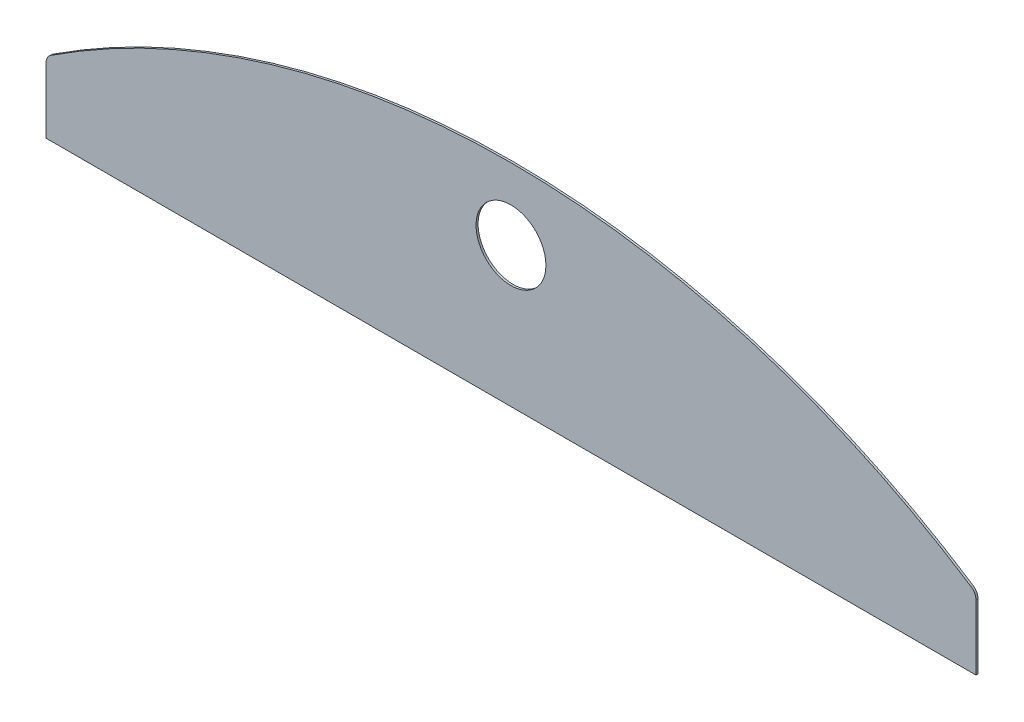
ISO-10303-21;
HEADER;
FILE_DESCRIPTION(('STEP AP214'),'2;1');
FILE_NAME('part.step','',(''),(''),'','','');
FILE_SCHEMA(('AUTOMOTIVE_DESIGN { 1 0 10303 214 1 1 1 1 }'));
ENDSEC;
DATA;
#1=APPLICATION_CONTEXT('core data for automotive mechanical design processes');
#2=APPLICATION_PROTOCOL_DEFINITION('international standard','automotive_design',2000,#1);
#3=PRODUCT_CONTEXT('',#1,'mechanical');
#4=PRODUCT('Part','Part','',(#3));
#5=PRODUCT_RELATED_PRODUCT_CATEGORY('part','',(#4));
#6=PRODUCT_DEFINITION_FORMATION('','',#4);
#7=PRODUCT_DEFINITION_CONTEXT('part definition',#1,'design');
#8=PRODUCT_DEFINITION('design','',#6,#7);
#9=PRODUCT_DEFINITION_SHAPE('','',#8);
#10=(LENGTH_UNIT() NAMED_UNIT(*) SI_UNIT(.MILLI.,.METRE.));
#11=(NAMED_UNIT(*) PLANE_ANGLE_UNIT() SI_UNIT($,.RADIAN.));
#12=(NAMED_UNIT(*) SI_UNIT($,.STERADIAN.) SOLID_ANGLE_UNIT());
#13=UNCERTAINTY_MEASURE_WITH_UNIT(LENGTH_MEASURE(1.E-05),#10,'distance_accuracy_value','');
#14=(GEOMETRIC_REPRESENTATION_CONTEXT(3) GLOBAL_UNCERTAINTY_ASSIGNED_CONTEXT((#13)) GLOBAL_UNIT_ASSIGNED_CONTEXT((#10,
#11,#12)) REPRESENTATION_CONTEXT('',''));
#15=CARTESIAN_POINT('',(0.,0.,0.));
#16=DIRECTION('',(0.,0.,1.));
#17=DIRECTION('',(1.,0.,0.));
#18=AXIS2_PLACEMENT_3D('',#15,#16,#17);
#19=CARTESIAN_POINT('',(330.2,1077.34498137761,1.5));
#20=DIRECTION('',(0.,0.,-1.));
#21=DIRECTION('',(-1.,0.,0.));
#22=AXIS2_PLACEMENT_3D('',#19,#20,#21);
#23=CYLINDRICAL_SURFACE('',#22,7.85000000000002);
#24=CARTESIAN_POINT('',(330.2,1077.34498137761,0.));
#25=DIRECTION('',(0.,0.,1.));
#26=DIRECTION('',(1.,0.,0.));
#27=AXIS2_PLACEMENT_3D('',#24,#25,#26);
#28=CIRCLE('',#27,7.85000000000002);
#29=CARTESIAN_POINT('',(338.05,1077.34498137761,0.));
#30=VERTEX_POINT('',#29);
#31=CARTESIAN_POINT('',(334.496842105263,1083.91458166396,0.));
#32=VERTEX_POINT('',#31);
#33=EDGE_CURVE('E134',#30,#32,#28,.T.);
#34=ORIENTED_EDGE('',*,*,#33,.T.);
#35=DIRECTION('',(0.,0.,-1.));
#36=VECTOR('',#35,1.);
#37=CARTESIAN_POINT('',(334.496842105263,1083.91458166396,1.5));
#38=LINE('',#37,#36);
#39=CARTESIAN_POINT('',(334.496842105263,1083.91458166396,1.5));
#40=VERTEX_POINT('',#39);
#41=EDGE_CURVE('E11',#40,#32,#38,.T.);
#42=ORIENTED_EDGE('',*,*,#41,.F.);
#43=CARTESIAN_POINT('',(330.2,1077.34498137761,1.5));
#44=DIRECTION('',(0.,0.,1.));
#45=DIRECTION('',(1.,0.,0.));
#46=AXIS2_PLACEMENT_3D('',#43,#44,#45);
#47=CIRCLE('',#46,7.85000000000002);
#48=CARTESIAN_POINT('',(338.05,1077.34498137761,1.5));
#49=VERTEX_POINT('',#48);
#50=EDGE_CURVE('E147',#49,#40,#47,.T.);
#51=ORIENTED_EDGE('',*,*,#50,.F.);
#52=DIRECTION('',(0.,0.,-1.));
#53=VECTOR('',#52,1.);
#54=CARTESIAN_POINT('',(338.05,1077.34498137761,1.5));
#55=LINE('',#54,#53);
#56=EDGE_CURVE('E130',#49,#30,#55,.T.);
#57=ORIENTED_EDGE('',*,*,#56,.T.);
#58=EDGE_LOOP('',(#34,#42,#51,#57));
#59=FACE_BOUND('',#58,.T.);
#60=ADVANCED_FACE('F39',(#59),#23,.T.);
#61=CARTESIAN_POINT('',(-6.24527556405963E-13,572.490029435968,1.5));
#62=DIRECTION('',(0.,0.,-1.));
#63=DIRECTION('',(-1.,0.,0.));
#64=AXIS2_PLACEMENT_3D('',#61,#62,#63);
#65=CYLINDRICAL_SURFACE('',#64,611.099999999998);
#66=CARTESIAN_POINT('',(-6.24527556405963E-13,572.490029435968,0.));
#67=DIRECTION('',(0.,0.,1.));
#68=DIRECTION('',(1.,0.,0.));
#69=AXIS2_PLACEMENT_3D('',#66,#67,#68);
#70=CIRCLE('',#69,611.099999999998);
#71=CARTESIAN_POINT('',(-334.496842105263,1083.91458166396,0.));
#72=VERTEX_POINT('',#71);
#73=EDGE_CURVE('E138',#32,#72,#70,.T.);
#74=ORIENTED_EDGE('',*,*,#73,.T.);
#75=DIRECTION('',(0.,0.,-1.));
#76=VECTOR('',#75,1.);
#77=CARTESIAN_POINT('',(-334.496842105263,1083.91458166396,1.5));
#78=LINE('',#77,#76);
#79=CARTESIAN_POINT('',(-334.496842105263,1083.91458166396,1.5));
#80=VERTEX_POINT('',#79);
#81=EDGE_CURVE('E48',#80,#72,#78,.T.);
#82=ORIENTED_EDGE('',*,*,#81,.F.);
#83=CARTESIAN_POINT('',(-6.24527556405963E-13,572.490029435968,1.5));
#84=DIRECTION('',(0.,0.,1.));
#85=DIRECTION('',(1.,0.,0.));
#86=AXIS2_PLACEMENT_3D('',#83,#84,#85);
#87=CIRCLE('',#86,611.099999999998);
#88=EDGE_CURVE('E99',#40,#80,#87,.T.);
#89=ORIENTED_EDGE('',*,*,#88,.F.);
#90=ORIENTED_EDGE('',*,*,#41,.T.);
#91=EDGE_LOOP('',(#74,#82,#89,#90));
#92=FACE_BOUND('',#91,.T.);
#93=ADVANCED_FACE('F174',(#92),#65,.T.);
#94=CARTESIAN_POINT('',(-330.2,1077.34498137761,1.5));
#95=DIRECTION('',(0.,0.,-1.));
#96=DIRECTION('',(-1.,0.,0.));
#97=AXIS2_PLACEMENT_3D('',#94,#95,#96);
#98=CYLINDRICAL_SURFACE('',#97,7.85000000000002);
#99=CARTESIAN_POINT('',(-330.2,1077.34498137761,0.));
#100=DIRECTION('',(0.,0.,1.));
#101=DIRECTION('',(1.,0.,0.));
#102=AXIS2_PLACEMENT_3D('',#99,#100,#101);
#103=CIRCLE('',#102,7.85000000000002);
#104=CARTESIAN_POINT('',(-338.05,1077.34498137761,0.));
#105=VERTEX_POINT('',#104);
#106=EDGE_CURVE('E141',#72,#105,#103,.T.);
#107=ORIENTED_EDGE('',*,*,#106,.T.);
#108=DIRECTION('',(0.,0.,-1.));
#109=VECTOR('',#108,1.);
#110=CARTESIAN_POINT('',(-338.05,1077.34498137761,1.5));
#111=LINE('',#110,#109);
#112=CARTESIAN_POINT('',(-338.05,1077.34498137761,1.5));
#113=VERTEX_POINT('',#112);
#114=EDGE_CURVE('E121',#113,#105,#111,.T.);
#115=ORIENTED_EDGE('',*,*,#114,.F.);
#116=CARTESIAN_POINT('',(-330.2,1077.34498137761,1.5));
#117=DIRECTION('',(0.,0.,1.));
#118=DIRECTION('',(1.,0.,0.));
#119=AXIS2_PLACEMENT_3D('',#116,#117,#118);
#120=CIRCLE('',#119,7.85000000000002);
#121=EDGE_CURVE('E112',#80,#113,#120,.T.);
#122=ORIENTED_EDGE('',*,*,#121,.F.);
#123=ORIENTED_EDGE('',*,*,#81,.T.);
#124=EDGE_LOOP('',(#107,#115,#122,#123));
#125=FACE_BOUND('',#124,.T.);
#126=ADVANCED_FACE('F155',(#125),#98,.T.);
#127=CARTESIAN_POINT('',(-338.05,1029.96776601313,1.5));
#128=DIRECTION('',(1.,0.,0.));
#129=DIRECTION('',(0.,1.,0.));
#130=AXIS2_PLACEMENT_3D('',#127,#128,#129);
#131=PLANE('',#130);
#132=DIRECTION('',(0.,-1.,0.));
#133=VECTOR('',#132,1.);
#134=CARTESIAN_POINT('',(-338.05,1029.96776601313,0.));
#135=LINE('',#134,#133);
#136=CARTESIAN_POINT('',(-338.05,1029.96776601313,0.));
#137=VERTEX_POINT('',#136);
#138=EDGE_CURVE('E120',#105,#137,#135,.T.);
#139=ORIENTED_EDGE('',*,*,#138,.T.);
#140=DIRECTION('',(0.,0.,-1.));
#141=VECTOR('',#140,1.);
#142=CARTESIAN_POINT('',(-338.05,1029.96776601313,1.5));
#143=LINE('',#142,#141);
#144=CARTESIAN_POINT('',(-338.05,1029.96776601313,1.5));
#145=VERTEX_POINT('',#144);
#146=EDGE_CURVE('E117',#145,#137,#143,.T.);
#147=ORIENTED_EDGE('',*,*,#146,.F.);
#148=DIRECTION('',(0.,-1.,0.));
#149=VECTOR('',#148,1.);
#150=CARTESIAN_POINT('',(-338.05,1029.96776601313,1.5));
#151=LINE('',#150,#149);
#152=EDGE_CURVE('E106',#113,#145,#151,.T.);
#153=ORIENTED_EDGE('',*,*,#152,.F.);
#154=ORIENTED_EDGE('',*,*,#114,.T.);
#155=EDGE_LOOP('',(#139,#147,#153,#154));
#156=FACE_BOUND('',#155,.T.);
#157=ADVANCED_FACE('F118',(#156),#131,.F.);
#158=CARTESIAN_POINT('',(338.05,1029.96776601313,1.5));
#159=DIRECTION('',(0.,1.,0.));
#160=DIRECTION('',(0.,0.,1.));
#161=AXIS2_PLACEMENT_3D('',#158,#159,#160);
#162=PLANE('',#161);
#163=DIRECTION('',(1.,0.,0.));
#164=VECTOR('',#163,1.);
#165=CARTESIAN_POINT('',(338.05,1029.96776601313,0.));
#166=LINE('',#165,#164);
#167=CARTESIAN_POINT('',(338.05,1029.96776601313,0.));
#168=VERTEX_POINT('',#167);
#169=EDGE_CURVE('E84',#137,#168,#166,.T.);
#170=ORIENTED_EDGE('',*,*,#169,.T.);
#171=DIRECTION('',(0.,0.,-1.));
#172=VECTOR('',#171,1.);
#173=CARTESIAN_POINT('',(338.05,1029.96776601313,1.5));
#174=LINE('',#173,#172);
#175=CARTESIAN_POINT('',(338.05,1029.96776601313,1.5));
#176=VERTEX_POINT('',#175);
#177=EDGE_CURVE('E122',#176,#168,#174,.T.);
#178=ORIENTED_EDGE('',*,*,#177,.F.);
#179=DIRECTION('',(1.,0.,0.));
#180=VECTOR('',#179,1.);
#181=CARTESIAN_POINT('',(338.05,1029.96776601313,1.5));
#182=LINE('',#181,#180);
#183=EDGE_CURVE('E110',#145,#176,#182,.T.);
#184=ORIENTED_EDGE('',*,*,#183,.F.);
#185=ORIENTED_EDGE('',*,*,#146,.T.);
#186=EDGE_LOOP('',(#170,#178,#184,#185));
#187=FACE_BOUND('',#186,.T.);
#188=ADVANCED_FACE('F124',(#187),#162,.F.);
#189=CARTESIAN_POINT('',(338.05,1029.96776601313,1.5));
#190=DIRECTION('',(-1.,0.,0.));
#191=DIRECTION('',(0.,-1.,0.));
#192=AXIS2_PLACEMENT_3D('',#189,#190,#191);
#193=PLANE('',#192);
#194=DIRECTION('',(0.,1.,0.));
#195=VECTOR('',#194,1.);
#196=CARTESIAN_POINT('',(338.05,1029.96776601313,0.));
#197=LINE('',#196,#195);
#198=EDGE_CURVE('E91',#168,#30,#197,.T.);
#199=ORIENTED_EDGE('',*,*,#198,.T.);
#200=ORIENTED_EDGE('',*,*,#56,.F.);
#201=DIRECTION('',(0.,1.,0.));
#202=VECTOR('',#201,1.);
#203=CARTESIAN_POINT('',(338.05,1029.96776601313,1.5));
#204=LINE('',#203,#202);
#205=EDGE_CURVE('E59',#176,#49,#204,.T.);
#206=ORIENTED_EDGE('',*,*,#205,.F.);
#207=ORIENTED_EDGE('',*,*,#177,.T.);
#208=EDGE_LOOP('',(#199,#200,#206,#207));
#209=FACE_BOUND('',#208,.T.);
#210=ADVANCED_FACE('F162',(#209),#193,.F.);
#211=CARTESIAN_POINT('',(330.2,1077.34498137761,1.5));
#212=DIRECTION('',(0.,0.,1.));
#213=DIRECTION('',(1.,0.,0.));
#214=AXIS2_PLACEMENT_3D('',#211,#212,#213);
#215=PLANE('',#214);
#216=CARTESIAN_POINT('',(0.,1131.56776601313,1.5));
#217=DIRECTION('',(0.,0.,1.));
#218=DIRECTION('',(1.,0.,0.));
#219=AXIS2_PLACEMENT_3D('',#216,#217,#218);
#220=CIRCLE('',#219,25.4);
#221=CARTESIAN_POINT('',(25.4,1131.56776601313,1.5));
#222=VERTEX_POINT('',#221);
#223=EDGE_CURVE('E231',#222,#222,#220,.T.);
#224=ORIENTED_EDGE('',*,*,#223,.F.);
#225=EDGE_LOOP('',(#224));
#226=FACE_BOUND('',#225,.T.);
#227=ORIENTED_EDGE('',*,*,#50,.T.);
#228=ORIENTED_EDGE('',*,*,#88,.T.);
#229=ORIENTED_EDGE('',*,*,#121,.T.);
#230=ORIENTED_EDGE('',*,*,#152,.T.);
#231=ORIENTED_EDGE('',*,*,#183,.T.);
#232=ORIENTED_EDGE('',*,*,#205,.T.);
#233=EDGE_LOOP('',(#227,#228,#229,#230,#231,#232));
#234=FACE_BOUND('',#233,.T.);
#235=ADVANCED_FACE('F108',(#226,#234),#215,.T.);
#236=CARTESIAN_POINT('',(330.2,1077.34498137761,0.));
#237=DIRECTION('',(0.,0.,1.));
#238=DIRECTION('',(1.,0.,0.));
#239=AXIS2_PLACEMENT_3D('',#236,#237,#238);
#240=PLANE('',#239);
#241=CARTESIAN_POINT('',(0.,1131.56776601313,0.));
#242=DIRECTION('',(0.,0.,1.));
#243=DIRECTION('',(1.,0.,0.));
#244=AXIS2_PLACEMENT_3D('',#241,#242,#243);
#245=CIRCLE('',#244,25.4);
#246=CARTESIAN_POINT('',(25.4,1131.56776601313,0.));
#247=VERTEX_POINT('',#246);
#248=EDGE_CURVE('E139',#247,#247,#245,.T.);
#249=ORIENTED_EDGE('',*,*,#248,.T.);
#250=EDGE_LOOP('',(#249));
#251=FACE_BOUND('',#250,.T.);
#252=ORIENTED_EDGE('',*,*,#33,.F.);
#253=ORIENTED_EDGE('',*,*,#198,.F.);
#254=ORIENTED_EDGE('',*,*,#169,.F.);
#255=ORIENTED_EDGE('',*,*,#138,.F.);
#256=ORIENTED_EDGE('',*,*,#106,.F.);
#257=ORIENTED_EDGE('',*,*,#73,.F.);
#258=EDGE_LOOP('',(#252,#253,#254,#255,#256,#257));
#259=FACE_BOUND('',#258,.T.);
#260=ADVANCED_FACE('F158',(#251,#259),#240,.F.);
#261=CARTESIAN_POINT('',(0.,1131.56776601313,0.));
#262=DIRECTION('',(0.,0.,1.));
#263=DIRECTION('',(1.,0.,0.));
#264=AXIS2_PLACEMENT_3D('',#261,#262,#263);
#265=CYLINDRICAL_SURFACE('',#264,25.4);
#266=ORIENTED_EDGE('',*,*,#248,.F.);
#267=EDGE_LOOP('',(#266));
#268=FACE_BOUND('',#267,.T.);
#269=ORIENTED_EDGE('',*,*,#223,.T.);
#270=EDGE_LOOP('',(#269));
#271=FACE_BOUND('',#270,.T.);
#272=ADVANCED_FACE('F212',(#268,#271),#265,.F.);
#273=CLOSED_SHELL('',(#60,#93,#126,#157,#188,#210,#235,#260,#272));
#274=MANIFOLD_SOLID_BREP('B2',#273);
#275=ADVANCED_BREP_SHAPE_REPRESENTATION('',(#18,#274),#14);
#276=SHAPE_DEFINITION_REPRESENTATION(#9,#275);
ENDSEC;
END-ISO-10303-21;
